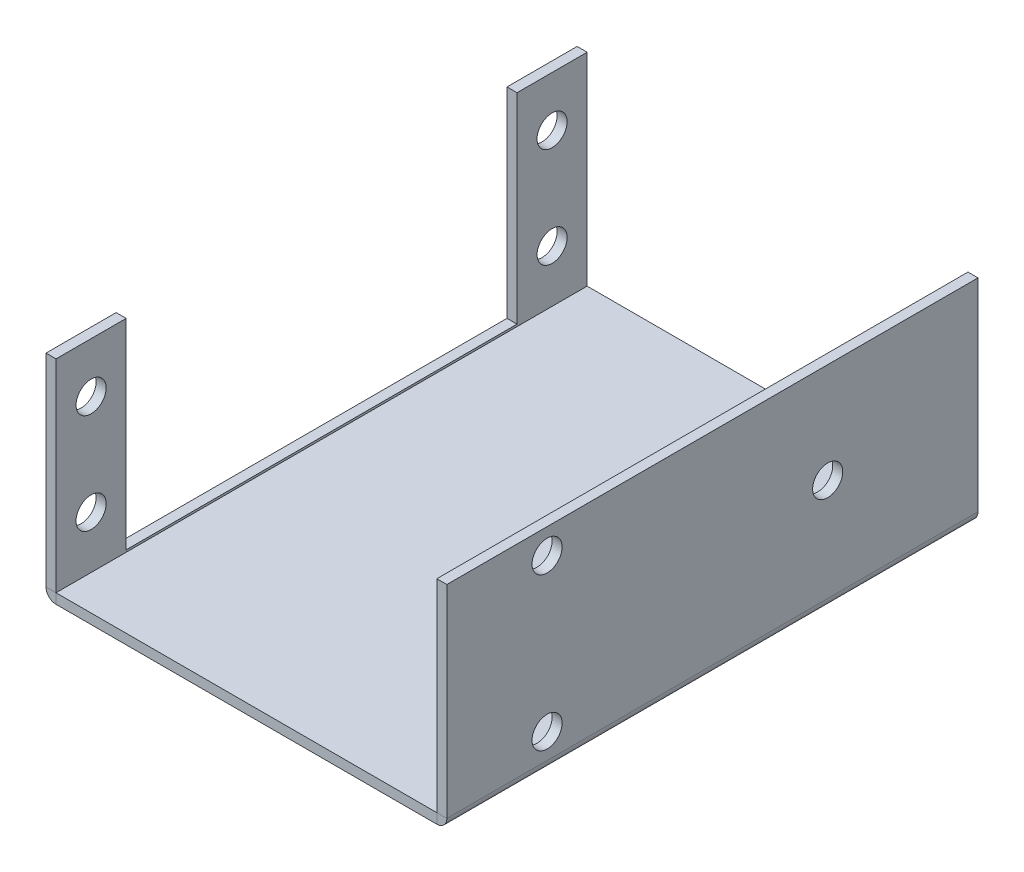
ISO-10303-21;
HEADER;
FILE_DESCRIPTION(('STEP AP214'),'2;1');
FILE_NAME('part.step','',(''),(''),'','','');
FILE_SCHEMA(('AUTOMOTIVE_DESIGN { 1 0 10303 214 1 1 1 1 }'));
ENDSEC;
DATA;
#1=APPLICATION_CONTEXT('core data for automotive mechanical design processes');
#2=APPLICATION_PROTOCOL_DEFINITION('international standard','automotive_design',2000,#1);
#3=PRODUCT_CONTEXT('',#1,'mechanical');
#4=PRODUCT('Part','Part','',(#3));
#5=PRODUCT_RELATED_PRODUCT_CATEGORY('part','',(#4));
#6=PRODUCT_DEFINITION_FORMATION('','',#4);
#7=PRODUCT_DEFINITION_CONTEXT('part definition',#1,'design');
#8=PRODUCT_DEFINITION('design','',#6,#7);
#9=PRODUCT_DEFINITION_SHAPE('','',#8);
#10=(LENGTH_UNIT() NAMED_UNIT(*) SI_UNIT(.MILLI.,.METRE.));
#11=(NAMED_UNIT(*) PLANE_ANGLE_UNIT() SI_UNIT($,.RADIAN.));
#12=(NAMED_UNIT(*) SI_UNIT($,.STERADIAN.) SOLID_ANGLE_UNIT());
#13=UNCERTAINTY_MEASURE_WITH_UNIT(LENGTH_MEASURE(1.E-05),#10,'distance_accuracy_value','');
#14=(GEOMETRIC_REPRESENTATION_CONTEXT(3) GLOBAL_UNCERTAINTY_ASSIGNED_CONTEXT((#13)) GLOBAL_UNIT_ASSIGNED_CONTEXT((#10,
#11,#12)) REPRESENTATION_CONTEXT('',''));
#15=CARTESIAN_POINT('',(0.,0.,0.));
#16=DIRECTION('',(0.,0.,1.));
#17=DIRECTION('',(1.,0.,0.));
#18=AXIS2_PLACEMENT_3D('',#15,#16,#17);
#19=CARTESIAN_POINT('',(0.,1.,0.));
#20=DIRECTION('',(0.,0.,1.));
#21=DIRECTION('',(-1.,0.,0.));
#22=AXIS2_PLACEMENT_3D('',#19,#20,#21);
#23=PLANE('',#22);
#24=DIRECTION('',(-1.,0.,0.));
#25=VECTOR('',#24,1.);
#26=CARTESIAN_POINT('',(0.,1.,0.));
#27=LINE('',#26,#25);
#28=CARTESIAN_POINT('',(-21.,1.,0.));
#29=VERTEX_POINT('',#28);
#30=CARTESIAN_POINT('',(-59.,1.,0.));
#31=VERTEX_POINT('',#30);
#32=EDGE_CURVE('E204',#29,#31,#27,.T.);
#33=ORIENTED_EDGE('',*,*,#32,.F.);
#34=DIRECTION('',(0.,-1.,0.));
#35=VECTOR('',#34,1.);
#36=CARTESIAN_POINT('',(-21.,1.,0.));
#37=LINE('',#36,#35);
#38=CARTESIAN_POINT('',(-21.,0.,0.));
#39=VERTEX_POINT('',#38);
#40=EDGE_CURVE('E12',#29,#39,#37,.T.);
#41=ORIENTED_EDGE('',*,*,#40,.T.);
#42=DIRECTION('',(1.,0.,0.));
#43=VECTOR('',#42,1.);
#44=CARTESIAN_POINT('',(0.,0.,0.));
#45=LINE('',#44,#43);
#46=CARTESIAN_POINT('',(-59.,0.,0.));
#47=VERTEX_POINT('',#46);
#48=EDGE_CURVE('E196',#39,#47,#45,.F.);
#49=ORIENTED_EDGE('',*,*,#48,.T.);
#50=DIRECTION('',(0.,1.,0.));
#51=VECTOR('',#50,1.);
#52=CARTESIAN_POINT('',(-59.,1.,0.));
#53=LINE('',#52,#51);
#54=EDGE_CURVE('E192',#47,#31,#53,.T.);
#55=ORIENTED_EDGE('',*,*,#54,.T.);
#56=EDGE_LOOP('',(#33,#41,#49,#55));
#57=FACE_BOUND('',#56,.T.);
#58=ADVANCED_FACE('F42',(#57),#23,.F.);
#59=CARTESIAN_POINT('',(0.,0.,0.));
#60=DIRECTION('',(0.,-1.,0.));
#61=DIRECTION('',(0.,0.,-1.));
#62=AXIS2_PLACEMENT_3D('',#59,#60,#61);
#63=PLANE('',#62);
#64=ORIENTED_EDGE('',*,*,#48,.F.);
#65=DIRECTION('',(0.,0.,1.));
#66=VECTOR('',#65,1.);
#67=CARTESIAN_POINT('',(-21.,0.,0.));
#68=LINE('',#67,#66);
#69=CARTESIAN_POINT('',(-21.,0.,53.));
#70=VERTEX_POINT('',#69);
#71=EDGE_CURVE('E50',#39,#70,#68,.T.);
#72=ORIENTED_EDGE('',*,*,#71,.T.);
#73=DIRECTION('',(1.,0.,0.));
#74=VECTOR('',#73,1.);
#75=CARTESIAN_POINT('',(0.,0.,53.));
#76=LINE('',#75,#74);
#77=CARTESIAN_POINT('',(-59.,0.,53.));
#78=VERTEX_POINT('',#77);
#79=EDGE_CURVE('E200',#78,#70,#76,.T.);
#80=ORIENTED_EDGE('',*,*,#79,.F.);
#81=DIRECTION('',(0.,0.,-1.));
#82=VECTOR('',#81,1.);
#83=CARTESIAN_POINT('',(-59.,0.,0.));
#84=LINE('',#83,#82);
#85=EDGE_CURVE('E197',#78,#47,#84,.T.);
#86=ORIENTED_EDGE('',*,*,#85,.T.);
#87=EDGE_LOOP('',(#64,#72,#80,#86));
#88=FACE_BOUND('',#87,.T.);
#89=ADVANCED_FACE('F354',(#88),#63,.T.);
#90=CARTESIAN_POINT('',(0.,1.,53.));
#91=DIRECTION('',(0.,0.,-1.));
#92=DIRECTION('',(1.,0.,0.));
#93=AXIS2_PLACEMENT_3D('',#90,#91,#92);
#94=PLANE('',#93);
#95=ORIENTED_EDGE('',*,*,#79,.T.);
#96=DIRECTION('',(0.,1.,0.));
#97=VECTOR('',#96,1.);
#98=CARTESIAN_POINT('',(-21.,1.,53.));
#99=LINE('',#98,#97);
#100=CARTESIAN_POINT('',(-21.,1.,53.));
#101=VERTEX_POINT('',#100);
#102=EDGE_CURVE('E293',#70,#101,#99,.T.);
#103=ORIENTED_EDGE('',*,*,#102,.T.);
#104=DIRECTION('',(1.,0.,0.));
#105=VECTOR('',#104,1.);
#106=CARTESIAN_POINT('',(0.,1.,53.));
#107=LINE('',#106,#105);
#108=CARTESIAN_POINT('',(-59.,1.,53.));
#109=VERTEX_POINT('',#108);
#110=EDGE_CURVE('E207',#109,#101,#107,.T.);
#111=ORIENTED_EDGE('',*,*,#110,.F.);
#112=DIRECTION('',(0.,-1.,0.));
#113=VECTOR('',#112,1.);
#114=CARTESIAN_POINT('',(-59.,1.,53.));
#115=LINE('',#114,#113);
#116=EDGE_CURVE('E201',#109,#78,#115,.T.);
#117=ORIENTED_EDGE('',*,*,#116,.T.);
#118=EDGE_LOOP('',(#95,#103,#111,#117));
#119=FACE_BOUND('',#118,.T.);
#120=ADVANCED_FACE('F399',(#119),#94,.F.);
#121=CARTESIAN_POINT('',(-59.0000000000002,-58.7853981633975,0.));
#122=DIRECTION('',(-1.,0.,0.));
#123=DIRECTION('',(0.,0.,-1.));
#124=AXIS2_PLACEMENT_3D('',#121,#122,#123);
#125=PLANE('',#124);
#126=CARTESIAN_POINT('',(-59.,16.2146018366026,3.5));
#127=DIRECTION('',(-1.,0.,0.));
#128=DIRECTION('',(0.,0.,-1.));
#129=AXIS2_PLACEMENT_3D('',#126,#127,#128);
#130=CIRCLE('',#129,1.5);
#131=CARTESIAN_POINT('',(-59.,16.2146018366026,2.00000000000001));
#132=VERTEX_POINT('',#131);
#133=EDGE_CURVE('E218',#132,#132,#130,.F.);
#134=ORIENTED_EDGE('',*,*,#133,.F.);
#135=EDGE_LOOP('',(#134));
#136=FACE_BOUND('',#135,.T.);
#137=CARTESIAN_POINT('',(-59.,6.21460183660256,3.5));
#138=DIRECTION('',(-1.,0.,0.));
#139=DIRECTION('',(0.,0.,-1.));
#140=AXIS2_PLACEMENT_3D('',#137,#138,#139);
#141=CIRCLE('',#140,1.5);
#142=CARTESIAN_POINT('',(-59.,6.21460183660256,2.00000000000001));
#143=VERTEX_POINT('',#142);
#144=EDGE_CURVE('E215',#143,#143,#141,.F.);
#145=ORIENTED_EDGE('',*,*,#144,.F.);
#146=EDGE_LOOP('',(#145));
#147=FACE_BOUND('',#146,.T.);
#148=CARTESIAN_POINT('',(-59.,16.2146018366026,49.5));
#149=DIRECTION('',(-1.,0.,0.));
#150=DIRECTION('',(0.,0.,-1.));
#151=AXIS2_PLACEMENT_3D('',#148,#149,#150);
#152=CIRCLE('',#151,1.5);
#153=CARTESIAN_POINT('',(-59.,16.2146018366026,48.));
#154=VERTEX_POINT('',#153);
#155=EDGE_CURVE('E211',#154,#154,#152,.F.);
#156=ORIENTED_EDGE('',*,*,#155,.F.);
#157=EDGE_LOOP('',(#156));
#158=FACE_BOUND('',#157,.T.);
#159=CARTESIAN_POINT('',(-59.,6.21460183660256,49.5));
#160=DIRECTION('',(-1.,0.,0.));
#161=DIRECTION('',(0.,0.,-1.));
#162=AXIS2_PLACEMENT_3D('',#159,#160,#161);
#163=CIRCLE('',#162,1.5);
#164=CARTESIAN_POINT('',(-59.,6.21460183660256,48.));
#165=VERTEX_POINT('',#164);
#166=EDGE_CURVE('E208',#165,#165,#163,.F.);
#167=ORIENTED_EDGE('',*,*,#166,.F.);
#168=EDGE_LOOP('',(#167));
#169=FACE_BOUND('',#168,.T.);
#170=DIRECTION('',(0.,-1.,0.));
#171=VECTOR('',#170,1.);
#172=CARTESIAN_POINT('',(-59.0000000000002,-58.7853981633975,53.));
#173=LINE('',#172,#171);
#174=CARTESIAN_POINT('',(-58.9999999999999,21.2146018366026,53.));
#175=VERTEX_POINT('',#174);
#176=EDGE_CURVE('E237',#175,#109,#173,.T.);
#177=ORIENTED_EDGE('',*,*,#176,.T.);
#178=DIRECTION('',(0.,0.,-1.));
#179=VECTOR('',#178,1.);
#180=CARTESIAN_POINT('',(-59.,1.,0.));
#181=LINE('',#180,#179);
#182=EDGE_CURVE('E191',#109,#31,#181,.T.);
#183=ORIENTED_EDGE('',*,*,#182,.T.);
#184=DIRECTION('',(0.,1.,0.));
#185=VECTOR('',#184,1.);
#186=CARTESIAN_POINT('',(-59.0000000000002,-58.7853981633975,0.));
#187=LINE('',#186,#185);
#188=CARTESIAN_POINT('',(-58.9999999999999,21.2146018366026,0.));
#189=VERTEX_POINT('',#188);
#190=EDGE_CURVE('E221',#31,#189,#187,.T.);
#191=ORIENTED_EDGE('',*,*,#190,.T.);
#192=DIRECTION('',(0.,0.,1.));
#193=VECTOR('',#192,1.);
#194=CARTESIAN_POINT('',(-58.9999999999999,21.2146018366026,0.));
#195=LINE('',#194,#193);
#196=CARTESIAN_POINT('',(-58.9999999999999,21.2146018366026,7.00000000000001));
#197=VERTEX_POINT('',#196);
#198=EDGE_CURVE('E222',#189,#197,#195,.T.);
#199=ORIENTED_EDGE('',*,*,#198,.T.);
#200=DIRECTION('',(0.,-1.,0.));
#201=VECTOR('',#200,1.);
#202=CARTESIAN_POINT('',(-58.9999999999999,21.2146018366026,7.00000000000001));
#203=LINE('',#202,#201);
#204=CARTESIAN_POINT('',(-59.,1.21460183660255,7.00000000000001));
#205=VERTEX_POINT('',#204);
#206=EDGE_CURVE('E225',#197,#205,#203,.T.);
#207=ORIENTED_EDGE('',*,*,#206,.T.);
#208=DIRECTION('',(0.,0.,1.));
#209=VECTOR('',#208,1.);
#210=CARTESIAN_POINT('',(-59.,1.21460183660255,7.00000000000001));
#211=LINE('',#210,#209);
#212=CARTESIAN_POINT('',(-59.,1.21460183660255,46.));
#213=VERTEX_POINT('',#212);
#214=EDGE_CURVE('E228',#205,#213,#211,.T.);
#215=ORIENTED_EDGE('',*,*,#214,.T.);
#216=DIRECTION('',(0.,1.,0.));
#217=VECTOR('',#216,1.);
#218=CARTESIAN_POINT('',(-58.9999999999999,21.2146018366026,46.));
#219=LINE('',#218,#217);
#220=CARTESIAN_POINT('',(-58.9999999999999,21.2146018366026,46.));
#221=VERTEX_POINT('',#220);
#222=EDGE_CURVE('E231',#213,#221,#219,.T.);
#223=ORIENTED_EDGE('',*,*,#222,.T.);
#224=DIRECTION('',(0.,0.,1.));
#225=VECTOR('',#224,1.);
#226=CARTESIAN_POINT('',(-58.9999999999999,21.2146018366026,53.));
#227=LINE('',#226,#225);
#228=EDGE_CURVE('E234',#221,#175,#227,.T.);
#229=ORIENTED_EDGE('',*,*,#228,.T.);
#230=EDGE_LOOP('',(#177,#183,#191,#199,#207,#215,#223,#229));
#231=FACE_BOUND('',#230,.T.);
#232=ADVANCED_FACE('F403',(#136,#147,#158,#169,#231),#125,.F.);
#233=CARTESIAN_POINT('',(-58.9999999999999,21.2146018366026,0.));
#234=DIRECTION('',(0.,-1.,0.));
#235=DIRECTION('',(0.,0.,1.));
#236=AXIS2_PLACEMENT_3D('',#233,#234,#235);
#237=PLANE('',#236);
#238=DIRECTION('',(1.,0.,0.));
#239=VECTOR('',#238,1.);
#240=CARTESIAN_POINT('',(-58.9999999999999,21.2146018366026,0.));
#241=LINE('',#240,#239);
#242=CARTESIAN_POINT('',(-59.9999999999999,21.2146018366026,0.));
#243=VERTEX_POINT('',#242);
#244=EDGE_CURVE('E274',#243,#189,#241,.T.);
#245=ORIENTED_EDGE('',*,*,#244,.F.);
#246=DIRECTION('',(0.,0.,-1.));
#247=VECTOR('',#246,1.);
#248=CARTESIAN_POINT('',(-59.9999999999999,21.2146018366026,0.));
#249=LINE('',#248,#247);
#250=CARTESIAN_POINT('',(-59.9999999999999,21.2146018366026,7.00000000000001));
#251=VERTEX_POINT('',#250);
#252=EDGE_CURVE('E261',#243,#251,#249,.F.);
#253=ORIENTED_EDGE('',*,*,#252,.T.);
#254=DIRECTION('',(1.,0.,0.));
#255=VECTOR('',#254,1.);
#256=CARTESIAN_POINT('',(-58.9999999999999,21.2146018366026,7.00000000000001));
#257=LINE('',#256,#255);
#258=EDGE_CURVE('E272',#251,#197,#257,.T.);
#259=ORIENTED_EDGE('',*,*,#258,.T.);
#260=ORIENTED_EDGE('',*,*,#198,.F.);
#261=EDGE_LOOP('',(#245,#253,#259,#260));
#262=FACE_BOUND('',#261,.T.);
#263=ADVANCED_FACE('F415',(#262),#237,.F.);
#264=CARTESIAN_POINT('',(-58.9999999999999,21.2146018366026,7.00000000000001));
#265=DIRECTION('',(0.,0.,-1.));
#266=DIRECTION('',(0.,-1.,0.));
#267=AXIS2_PLACEMENT_3D('',#264,#265,#266);
#268=PLANE('',#267);
#269=ORIENTED_EDGE('',*,*,#258,.F.);
#270=DIRECTION('',(0.,-1.,0.));
#271=VECTOR('',#270,1.);
#272=CARTESIAN_POINT('',(-60.0000000000002,-58.7853981633974,7.00000000000001));
#273=LINE('',#272,#271);
#274=CARTESIAN_POINT('',(-60.,1.21460183660255,7.00000000000001));
#275=VERTEX_POINT('',#274);
#276=EDGE_CURVE('E258',#251,#275,#273,.T.);
#277=ORIENTED_EDGE('',*,*,#276,.T.);
#278=DIRECTION('',(1.,0.,0.));
#279=VECTOR('',#278,1.);
#280=CARTESIAN_POINT('',(-59.,1.21460183660255,7.00000000000001));
#281=LINE('',#280,#279);
#282=EDGE_CURVE('E270',#275,#205,#281,.T.);
#283=ORIENTED_EDGE('',*,*,#282,.T.);
#284=ORIENTED_EDGE('',*,*,#206,.F.);
#285=EDGE_LOOP('',(#269,#277,#283,#284));
#286=FACE_BOUND('',#285,.T.);
#287=ADVANCED_FACE('F419',(#286),#268,.F.);
#288=CARTESIAN_POINT('',(-59.,1.21460183660255,7.00000000000001));
#289=DIRECTION('',(0.,-1.,0.));
#290=DIRECTION('',(0.,0.,1.));
#291=AXIS2_PLACEMENT_3D('',#288,#289,#290);
#292=PLANE('',#291);
#293=ORIENTED_EDGE('',*,*,#282,.F.);
#294=DIRECTION('',(0.,0.,-1.));
#295=VECTOR('',#294,1.);
#296=CARTESIAN_POINT('',(-60.,1.21460183660255,0.));
#297=LINE('',#296,#295);
#298=CARTESIAN_POINT('',(-60.,1.21460183660255,46.));
#299=VERTEX_POINT('',#298);
#300=EDGE_CURVE('E255',#275,#299,#297,.F.);
#301=ORIENTED_EDGE('',*,*,#300,.T.);
#302=DIRECTION('',(1.,0.,0.));
#303=VECTOR('',#302,1.);
#304=CARTESIAN_POINT('',(-59.,1.21460183660255,46.));
#305=LINE('',#304,#303);
#306=EDGE_CURVE('E268',#299,#213,#305,.T.);
#307=ORIENTED_EDGE('',*,*,#306,.T.);
#308=ORIENTED_EDGE('',*,*,#214,.F.);
#309=EDGE_LOOP('',(#293,#301,#307,#308));
#310=FACE_BOUND('',#309,.T.);
#311=ADVANCED_FACE('F423',(#310),#292,.F.);
#312=CARTESIAN_POINT('',(-58.9999999999999,21.2146018366026,46.));
#313=DIRECTION('',(0.,0.,1.));
#314=DIRECTION('',(0.,1.,0.));
#315=AXIS2_PLACEMENT_3D('',#312,#313,#314);
#316=PLANE('',#315);
#317=ORIENTED_EDGE('',*,*,#306,.F.);
#318=DIRECTION('',(0.,-1.,0.));
#319=VECTOR('',#318,1.);
#320=CARTESIAN_POINT('',(-60.0000000000002,-58.7853981633974,46.));
#321=LINE('',#320,#319);
#322=CARTESIAN_POINT('',(-59.9999999999999,21.2146018366026,46.));
#323=VERTEX_POINT('',#322);
#324=EDGE_CURVE('E252',#299,#323,#321,.F.);
#325=ORIENTED_EDGE('',*,*,#324,.T.);
#326=DIRECTION('',(1.,0.,0.));
#327=VECTOR('',#326,1.);
#328=CARTESIAN_POINT('',(-58.9999999999999,21.2146018366026,46.));
#329=LINE('',#328,#327);
#330=EDGE_CURVE('E266',#323,#221,#329,.T.);
#331=ORIENTED_EDGE('',*,*,#330,.T.);
#332=ORIENTED_EDGE('',*,*,#222,.F.);
#333=EDGE_LOOP('',(#317,#325,#331,#332));
#334=FACE_BOUND('',#333,.T.);
#335=ADVANCED_FACE('F427',(#334),#316,.F.);
#336=CARTESIAN_POINT('',(-58.9999999999999,21.2146018366026,53.));
#337=DIRECTION('',(0.,-1.,0.));
#338=DIRECTION('',(0.,0.,1.));
#339=AXIS2_PLACEMENT_3D('',#336,#337,#338);
#340=PLANE('',#339);
#341=ORIENTED_EDGE('',*,*,#330,.F.);
#342=DIRECTION('',(0.,0.,-1.));
#343=VECTOR('',#342,1.);
#344=CARTESIAN_POINT('',(-59.9999999999999,21.2146018366026,0.));
#345=LINE('',#344,#343);
#346=CARTESIAN_POINT('',(-59.9999999999999,21.2146018366026,53.));
#347=VERTEX_POINT('',#346);
#348=EDGE_CURVE('E249',#323,#347,#345,.F.);
#349=ORIENTED_EDGE('',*,*,#348,.T.);
#350=DIRECTION('',(1.,0.,0.));
#351=VECTOR('',#350,1.);
#352=CARTESIAN_POINT('',(-58.9999999999999,21.2146018366026,53.));
#353=LINE('',#352,#351);
#354=EDGE_CURVE('E264',#347,#175,#353,.T.);
#355=ORIENTED_EDGE('',*,*,#354,.T.);
#356=ORIENTED_EDGE('',*,*,#228,.F.);
#357=EDGE_LOOP('',(#341,#349,#355,#356));
#358=FACE_BOUND('',#357,.T.);
#359=ADVANCED_FACE('F412',(#358),#340,.F.);
#360=CARTESIAN_POINT('',(-59.0000000000002,-58.7853981633975,53.));
#361=DIRECTION('',(0.,0.,-1.));
#362=DIRECTION('',(0.,-1.,0.));
#363=AXIS2_PLACEMENT_3D('',#360,#361,#362);
#364=PLANE('',#363);
#365=DIRECTION('',(-1.,0.,0.));
#366=VECTOR('',#365,1.);
#367=CARTESIAN_POINT('',(-59.,1.,53.));
#368=LINE('',#367,#366);
#369=CARTESIAN_POINT('',(-60.,1.00000000000001,53.));
#370=VERTEX_POINT('',#369);
#371=EDGE_CURVE('E277',#109,#370,#368,.T.);
#372=ORIENTED_EDGE('',*,*,#371,.F.);
#373=ORIENTED_EDGE('',*,*,#176,.F.);
#374=ORIENTED_EDGE('',*,*,#354,.F.);
#375=DIRECTION('',(0.,-1.,0.));
#376=VECTOR('',#375,1.);
#377=CARTESIAN_POINT('',(-60.0000000000002,-58.7853981633974,53.));
#378=LINE('',#377,#376);
#379=EDGE_CURVE('E212',#347,#370,#378,.T.);
#380=ORIENTED_EDGE('',*,*,#379,.T.);
#381=EDGE_LOOP('',(#372,#373,#374,#380));
#382=FACE_BOUND('',#381,.T.);
#383=ADVANCED_FACE('F364',(#382),#364,.F.);
#384=CARTESIAN_POINT('',(-59.,6.21460183660256,49.5));
#385=DIRECTION('',(-1.,0.,0.));
#386=DIRECTION('',(0.,0.,-1.));
#387=AXIS2_PLACEMENT_3D('',#384,#385,#386);
#388=CYLINDRICAL_SURFACE('',#387,1.5);
#389=ORIENTED_EDGE('',*,*,#166,.T.);
#390=EDGE_LOOP('',(#389));
#391=FACE_BOUND('',#390,.T.);
#392=CARTESIAN_POINT('',(-60.,6.21460183660256,49.5));
#393=DIRECTION('',(-1.,0.,0.));
#394=DIRECTION('',(0.,0.,-1.));
#395=AXIS2_PLACEMENT_3D('',#392,#393,#394);
#396=CIRCLE('',#395,1.5);
#397=CARTESIAN_POINT('',(-60.,6.21460183660256,48.));
#398=VERTEX_POINT('',#397);
#399=EDGE_CURVE('E195',#398,#398,#396,.F.);
#400=ORIENTED_EDGE('',*,*,#399,.F.);
#401=EDGE_LOOP('',(#400));
#402=FACE_BOUND('',#401,.T.);
#403=ADVANCED_FACE('F411',(#391,#402),#388,.F.);
#404=CARTESIAN_POINT('',(-59.,16.2146018366026,49.5));
#405=DIRECTION('',(-1.,0.,0.));
#406=DIRECTION('',(0.,0.,-1.));
#407=AXIS2_PLACEMENT_3D('',#404,#405,#406);
#408=CYLINDRICAL_SURFACE('',#407,1.5);
#409=ORIENTED_EDGE('',*,*,#155,.T.);
#410=EDGE_LOOP('',(#409));
#411=FACE_BOUND('',#410,.T.);
#412=CARTESIAN_POINT('',(-60.,16.2146018366026,49.5));
#413=DIRECTION('',(-1.,0.,0.));
#414=DIRECTION('',(0.,0.,-1.));
#415=AXIS2_PLACEMENT_3D('',#412,#413,#414);
#416=CIRCLE('',#415,1.5);
#417=CARTESIAN_POINT('',(-60.,16.2146018366026,48.));
#418=VERTEX_POINT('',#417);
#419=EDGE_CURVE('E240',#418,#418,#416,.F.);
#420=ORIENTED_EDGE('',*,*,#419,.F.);
#421=EDGE_LOOP('',(#420));
#422=FACE_BOUND('',#421,.T.);
#423=ADVANCED_FACE('F391',(#411,#422),#408,.F.);
#424=CARTESIAN_POINT('',(-59.,6.21460183660256,3.5));
#425=DIRECTION('',(-1.,0.,0.));
#426=DIRECTION('',(0.,0.,-1.));
#427=AXIS2_PLACEMENT_3D('',#424,#425,#426);
#428=CYLINDRICAL_SURFACE('',#427,1.5);
#429=ORIENTED_EDGE('',*,*,#144,.T.);
#430=EDGE_LOOP('',(#429));
#431=FACE_BOUND('',#430,.T.);
#432=CARTESIAN_POINT('',(-60.,6.21460183660256,3.5));
#433=DIRECTION('',(-1.,0.,0.));
#434=DIRECTION('',(0.,0.,-1.));
#435=AXIS2_PLACEMENT_3D('',#432,#433,#434);
#436=CIRCLE('',#435,1.5);
#437=CARTESIAN_POINT('',(-60.,6.21460183660256,2.00000000000001));
#438=VERTEX_POINT('',#437);
#439=EDGE_CURVE('E243',#438,#438,#436,.F.);
#440=ORIENTED_EDGE('',*,*,#439,.F.);
#441=EDGE_LOOP('',(#440));
#442=FACE_BOUND('',#441,.T.);
#443=ADVANCED_FACE('F382',(#431,#442),#428,.F.);
#444=CARTESIAN_POINT('',(-59.,16.2146018366026,3.5));
#445=DIRECTION('',(-1.,0.,0.));
#446=DIRECTION('',(0.,0.,-1.));
#447=AXIS2_PLACEMENT_3D('',#444,#445,#446);
#448=CYLINDRICAL_SURFACE('',#447,1.5);
#449=ORIENTED_EDGE('',*,*,#133,.T.);
#450=EDGE_LOOP('',(#449));
#451=FACE_BOUND('',#450,.T.);
#452=CARTESIAN_POINT('',(-60.,16.2146018366026,3.5));
#453=DIRECTION('',(-1.,0.,0.));
#454=DIRECTION('',(0.,0.,-1.));
#455=AXIS2_PLACEMENT_3D('',#452,#453,#454);
#456=CIRCLE('',#455,1.5);
#457=CARTESIAN_POINT('',(-60.,16.2146018366026,2.00000000000001));
#458=VERTEX_POINT('',#457);
#459=EDGE_CURVE('E246',#458,#458,#456,.F.);
#460=ORIENTED_EDGE('',*,*,#459,.F.);
#461=EDGE_LOOP('',(#460));
#462=FACE_BOUND('',#461,.T.);
#463=ADVANCED_FACE('F380',(#451,#462),#448,.F.);
#464=CARTESIAN_POINT('',(-59.0000000000002,-58.7853981633975,0.));
#465=DIRECTION('',(0.,0.,1.));
#466=DIRECTION('',(0.,1.,0.));
#467=AXIS2_PLACEMENT_3D('',#464,#465,#466);
#468=PLANE('',#467);
#469=DIRECTION('',(1.,0.,0.));
#470=VECTOR('',#469,1.);
#471=CARTESIAN_POINT('',(-59.,1.,0.));
#472=LINE('',#471,#470);
#473=CARTESIAN_POINT('',(-60.,1.00000000000001,0.));
#474=VERTEX_POINT('',#473);
#475=EDGE_CURVE('E283',#474,#31,#472,.T.);
#476=ORIENTED_EDGE('',*,*,#475,.F.);
#477=DIRECTION('',(0.,-1.,0.));
#478=VECTOR('',#477,1.);
#479=CARTESIAN_POINT('',(-60.0000000000002,-58.7853981633974,0.));
#480=LINE('',#479,#478);
#481=EDGE_CURVE('E65',#474,#243,#480,.F.);
#482=ORIENTED_EDGE('',*,*,#481,.T.);
#483=ORIENTED_EDGE('',*,*,#244,.T.);
#484=ORIENTED_EDGE('',*,*,#190,.F.);
#485=EDGE_LOOP('',(#476,#482,#483,#484));
#486=FACE_BOUND('',#485,.T.);
#487=ADVANCED_FACE('F370',(#486),#468,.F.);
#488=CARTESIAN_POINT('',(-60.0000000000002,-58.7853981633974,0.));
#489=DIRECTION('',(-1.,0.,0.));
#490=DIRECTION('',(0.,0.,-1.));
#491=AXIS2_PLACEMENT_3D('',#488,#489,#490);
#492=PLANE('',#491);
#493=DIRECTION('',(0.,0.,-1.));
#494=VECTOR('',#493,1.);
#495=CARTESIAN_POINT('',(-60.,1.00000000000001,0.));
#496=LINE('',#495,#494);
#497=EDGE_CURVE('E280',#370,#474,#496,.T.);
#498=ORIENTED_EDGE('',*,*,#497,.F.);
#499=ORIENTED_EDGE('',*,*,#379,.F.);
#500=ORIENTED_EDGE('',*,*,#348,.F.);
#501=ORIENTED_EDGE('',*,*,#324,.F.);
#502=ORIENTED_EDGE('',*,*,#300,.F.);
#503=ORIENTED_EDGE('',*,*,#276,.F.);
#504=ORIENTED_EDGE('',*,*,#252,.F.);
#505=ORIENTED_EDGE('',*,*,#481,.F.);
#506=EDGE_LOOP('',(#498,#499,#500,#501,#502,#503,#504,#505));
#507=FACE_BOUND('',#506,.T.);
#508=ORIENTED_EDGE('',*,*,#399,.T.);
#509=EDGE_LOOP('',(#508));
#510=FACE_BOUND('',#509,.T.);
#511=ORIENTED_EDGE('',*,*,#419,.T.);
#512=EDGE_LOOP('',(#511));
#513=FACE_BOUND('',#512,.T.);
#514=ORIENTED_EDGE('',*,*,#439,.T.);
#515=EDGE_LOOP('',(#514));
#516=FACE_BOUND('',#515,.T.);
#517=ORIENTED_EDGE('',*,*,#459,.T.);
#518=EDGE_LOOP('',(#517));
#519=FACE_BOUND('',#518,.T.);
#520=ADVANCED_FACE('F367',(#507,#510,#513,#516,#519),#492,.T.);
#521=CARTESIAN_POINT('',(0.,1.,0.));
#522=DIRECTION('',(0.,-1.,0.));
#523=DIRECTION('',(0.,0.,-1.));
#524=AXIS2_PLACEMENT_3D('',#521,#522,#523);
#525=PLANE('',#524);
#526=DIRECTION('',(0.,0.,1.));
#527=VECTOR('',#526,1.);
#528=CARTESIAN_POINT('',(-21.,1.,0.));
#529=LINE('',#528,#527);
#530=EDGE_CURVE('E286',#29,#101,#529,.T.);
#531=ORIENTED_EDGE('',*,*,#530,.F.);
#532=ORIENTED_EDGE('',*,*,#32,.T.);
#533=ORIENTED_EDGE('',*,*,#182,.F.);
#534=ORIENTED_EDGE('',*,*,#110,.T.);
#535=EDGE_LOOP('',(#531,#532,#533,#534));
#536=FACE_BOUND('',#535,.T.);
#537=ADVANCED_FACE('F344',(#536),#525,.F.);
#538=CARTESIAN_POINT('',(-59.,1.,0.));
#539=DIRECTION('',(0.,0.,-1.));
#540=DIRECTION('',(-1.,0.,0.));
#541=AXIS2_PLACEMENT_3D('',#538,#539,#540);
#542=PLANE('',#541);
#543=CARTESIAN_POINT('',(-59.,1.,0.));
#544=DIRECTION('',(0.,0.,1.));
#545=DIRECTION('',(1.,0.,0.));
#546=AXIS2_PLACEMENT_3D('',#543,#544,#545);
#547=CIRCLE('',#546,1.00000000000001);
#548=EDGE_CURVE('E188',#474,#47,#547,.T.);
#549=ORIENTED_EDGE('',*,*,#548,.F.);
#550=ORIENTED_EDGE('',*,*,#475,.T.);
#551=ORIENTED_EDGE('',*,*,#54,.F.);
#552=EDGE_LOOP('',(#549,#550,#551));
#553=FACE_BOUND('',#552,.T.);
#554=ADVANCED_FACE('F351',(#553),#542,.T.);
#555=CARTESIAN_POINT('',(-59.,1.,53.));
#556=DIRECTION('',(0.,0.,1.));
#557=DIRECTION('',(1.,0.,0.));
#558=AXIS2_PLACEMENT_3D('',#555,#556,#557);
#559=CYLINDRICAL_SURFACE('',#558,1.00000000000001);
#560=CARTESIAN_POINT('',(-59.,1.,53.));
#561=DIRECTION('',(0.,0.,1.));
#562=DIRECTION('',(1.,0.,0.));
#563=AXIS2_PLACEMENT_3D('',#560,#561,#562);
#564=CIRCLE('',#563,1.00000000000001);
#565=EDGE_CURVE('E185',#370,#78,#564,.T.);
#566=ORIENTED_EDGE('',*,*,#565,.F.);
#567=ORIENTED_EDGE('',*,*,#497,.T.);
#568=ORIENTED_EDGE('',*,*,#548,.T.);
#569=ORIENTED_EDGE('',*,*,#85,.F.);
#570=EDGE_LOOP('',(#566,#567,#568,#569));
#571=FACE_BOUND('',#570,.T.);
#572=ADVANCED_FACE('F357',(#571),#559,.T.);
#573=CARTESIAN_POINT('',(-59.,1.,53.));
#574=DIRECTION('',(0.,0.,1.));
#575=DIRECTION('',(1.,0.,0.));
#576=AXIS2_PLACEMENT_3D('',#573,#574,#575);
#577=PLANE('',#576);
#578=ORIENTED_EDGE('',*,*,#371,.T.);
#579=ORIENTED_EDGE('',*,*,#565,.T.);
#580=ORIENTED_EDGE('',*,*,#116,.F.);
#581=EDGE_LOOP('',(#578,#579,#580));
#582=FACE_BOUND('',#581,.T.);
#583=ADVANCED_FACE('F360',(#582),#577,.T.);
#584=CARTESIAN_POINT('',(-21.,1.,53.));
#585=DIRECTION('',(0.,0.,1.));
#586=DIRECTION('',(1.,0.,0.));
#587=AXIS2_PLACEMENT_3D('',#584,#585,#586);
#588=PLANE('',#587);
#589=CARTESIAN_POINT('',(-21.,1.,53.));
#590=DIRECTION('',(0.,0.,-1.));
#591=DIRECTION('',(-1.,0.,0.));
#592=AXIS2_PLACEMENT_3D('',#589,#590,#591);
#593=CIRCLE('',#592,1.);
#594=CARTESIAN_POINT('',(-20.,1.,53.));
#595=VERTEX_POINT('',#594);
#596=EDGE_CURVE('E183',#595,#70,#593,.T.);
#597=ORIENTED_EDGE('',*,*,#596,.F.);
#598=DIRECTION('',(-1.,0.,0.));
#599=VECTOR('',#598,1.);
#600=CARTESIAN_POINT('',(-21.,1.,53.));
#601=LINE('',#600,#599);
#602=EDGE_CURVE('E171',#595,#101,#601,.T.);
#603=ORIENTED_EDGE('',*,*,#602,.T.);
#604=ORIENTED_EDGE('',*,*,#102,.F.);
#605=EDGE_LOOP('',(#597,#603,#604));
#606=FACE_BOUND('',#605,.T.);
#607=ADVANCED_FACE('F448',(#606),#588,.T.);
#608=CARTESIAN_POINT('',(-21.,1.,0.));
#609=DIRECTION('',(0.,0.,-1.));
#610=DIRECTION('',(-1.,0.,0.));
#611=AXIS2_PLACEMENT_3D('',#608,#609,#610);
#612=CYLINDRICAL_SURFACE('',#611,1.);
#613=CARTESIAN_POINT('',(-21.,1.,0.));
#614=DIRECTION('',(0.,0.,-1.));
#615=DIRECTION('',(-1.,0.,0.));
#616=AXIS2_PLACEMENT_3D('',#613,#614,#615);
#617=CIRCLE('',#616,1.);
#618=CARTESIAN_POINT('',(-20.,1.,0.));
#619=VERTEX_POINT('',#618);
#620=EDGE_CURVE('E164',#619,#39,#617,.T.);
#621=ORIENTED_EDGE('',*,*,#620,.F.);
#622=DIRECTION('',(0.,0.,1.));
#623=VECTOR('',#622,1.);
#624=CARTESIAN_POINT('',(-20.,1.,0.));
#625=LINE('',#624,#623);
#626=EDGE_CURVE('E163',#619,#595,#625,.T.);
#627=ORIENTED_EDGE('',*,*,#626,.T.);
#628=ORIENTED_EDGE('',*,*,#596,.T.);
#629=ORIENTED_EDGE('',*,*,#71,.F.);
#630=EDGE_LOOP('',(#621,#627,#628,#629));
#631=FACE_BOUND('',#630,.T.);
#632=ADVANCED_FACE('F465',(#631),#612,.T.);
#633=CARTESIAN_POINT('',(-21.,1.,0.));
#634=DIRECTION('',(0.,0.,-1.));
#635=DIRECTION('',(-1.,0.,0.));
#636=AXIS2_PLACEMENT_3D('',#633,#634,#635);
#637=PLANE('',#636);
#638=DIRECTION('',(1.,0.,0.));
#639=VECTOR('',#638,1.);
#640=CARTESIAN_POINT('',(-21.,1.,0.));
#641=LINE('',#640,#639);
#642=EDGE_CURVE('E178',#29,#619,#641,.T.);
#643=ORIENTED_EDGE('',*,*,#642,.T.);
#644=ORIENTED_EDGE('',*,*,#620,.T.);
#645=ORIENTED_EDGE('',*,*,#40,.F.);
#646=EDGE_LOOP('',(#643,#644,#645));
#647=FACE_BOUND('',#646,.T.);
#648=ADVANCED_FACE('F339',(#647),#637,.T.);
#649=CARTESIAN_POINT('',(-21.0000000000001,21.2146018366025,0.));
#650=DIRECTION('',(0.,-1.,0.));
#651=DIRECTION('',(0.,0.,-1.));
#652=AXIS2_PLACEMENT_3D('',#649,#650,#651);
#653=PLANE('',#652);
#654=DIRECTION('',(-1.,0.,0.));
#655=VECTOR('',#654,1.);
#656=CARTESIAN_POINT('',(-21.0000000000001,21.2146018366026,53.));
#657=LINE('',#656,#655);
#658=CARTESIAN_POINT('',(-20.0000000000001,21.2146018366026,53.));
#659=VERTEX_POINT('',#658);
#660=CARTESIAN_POINT('',(-21.0000000000001,21.2146018366026,53.));
#661=VERTEX_POINT('',#660);
#662=EDGE_CURVE('E170',#659,#661,#657,.T.);
#663=ORIENTED_EDGE('',*,*,#662,.F.);
#664=DIRECTION('',(0.,0.,-1.));
#665=VECTOR('',#664,1.);
#666=CARTESIAN_POINT('',(-20.0000000000001,21.2146018366026,0.));
#667=LINE('',#666,#665);
#668=CARTESIAN_POINT('',(-20.0000000000001,21.2146018366026,0.));
#669=VERTEX_POINT('',#668);
#670=EDGE_CURVE('E156',#659,#669,#667,.T.);
#671=ORIENTED_EDGE('',*,*,#670,.T.);
#672=DIRECTION('',(-1.,0.,0.));
#673=VECTOR('',#672,1.);
#674=CARTESIAN_POINT('',(-21.0000000000001,21.2146018366025,0.));
#675=LINE('',#674,#673);
#676=CARTESIAN_POINT('',(-21.0000000000001,21.2146018366025,0.));
#677=VERTEX_POINT('',#676);
#678=EDGE_CURVE('E144',#669,#677,#675,.T.);
#679=ORIENTED_EDGE('',*,*,#678,.T.);
#680=DIRECTION('',(0.,0.,-1.));
#681=VECTOR('',#680,1.);
#682=CARTESIAN_POINT('',(-21.0000000000001,21.2146018366025,0.));
#683=LINE('',#682,#681);
#684=EDGE_CURVE('E320',#661,#677,#683,.T.);
#685=ORIENTED_EDGE('',*,*,#684,.F.);
#686=EDGE_LOOP('',(#663,#671,#679,#685));
#687=FACE_BOUND('',#686,.T.);
#688=ADVANCED_FACE('F168',(#687),#653,.F.);
#689=CARTESIAN_POINT('',(-21.,11.2146018366026,15.));
#690=DIRECTION('',(1.,0.,0.));
#691=DIRECTION('',(0.,0.,-1.));
#692=AXIS2_PLACEMENT_3D('',#689,#690,#691);
#693=CYLINDRICAL_SURFACE('',#692,1.5);
#694=CARTESIAN_POINT('',(-21.,11.2146018366026,15.));
#695=DIRECTION('',(1.,0.,0.));
#696=DIRECTION('',(0.,0.,-1.));
#697=AXIS2_PLACEMENT_3D('',#694,#695,#696);
#698=CIRCLE('',#697,1.5);
#699=CARTESIAN_POINT('',(-21.,11.2146018366026,13.5));
#700=VERTEX_POINT('',#699);
#701=EDGE_CURVE('E155',#700,#700,#698,.F.);
#702=ORIENTED_EDGE('',*,*,#701,.T.);
#703=EDGE_LOOP('',(#702));
#704=FACE_BOUND('',#703,.T.);
#705=CARTESIAN_POINT('',(-20.,11.2146018366026,15.));
#706=DIRECTION('',(1.,0.,0.));
#707=DIRECTION('',(0.,0.,-1.));
#708=AXIS2_PLACEMENT_3D('',#705,#706,#707);
#709=CIRCLE('',#708,1.5);
#710=CARTESIAN_POINT('',(-20.,11.2146018366026,13.5));
#711=VERTEX_POINT('',#710);
#712=EDGE_CURVE('E165',#711,#711,#709,.F.);
#713=ORIENTED_EDGE('',*,*,#712,.F.);
#714=EDGE_LOOP('',(#713));
#715=FACE_BOUND('',#714,.T.);
#716=ADVANCED_FACE('F327',(#704,#715),#693,.F.);
#717=CARTESIAN_POINT('',(-21.0000000000001,21.2146018366025,0.));
#718=DIRECTION('',(1.,0.,0.));
#719=DIRECTION('',(0.,0.,-1.));
#720=AXIS2_PLACEMENT_3D('',#717,#718,#719);
#721=PLANE('',#720);
#722=CARTESIAN_POINT('',(-21.0000000000001,18.7146018366026,43.));
#723=DIRECTION('',(1.,0.,0.));
#724=DIRECTION('',(0.,1.,0.));
#725=AXIS2_PLACEMENT_3D('',#722,#723,#724);
#726=CIRCLE('',#725,1.5);
#727=CARTESIAN_POINT('',(-21.0000000000001,20.2146018366026,43.));
#728=VERTEX_POINT('',#727);
#729=EDGE_CURVE('E181',#728,#728,#726,.F.);
#730=ORIENTED_EDGE('',*,*,#729,.F.);
#731=EDGE_LOOP('',(#730));
#732=FACE_BOUND('',#731,.T.);
#733=CARTESIAN_POINT('',(-21.,3.5,43.));
#734=DIRECTION('',(1.,0.,0.));
#735=DIRECTION('',(0.,1.,0.));
#736=AXIS2_PLACEMENT_3D('',#733,#734,#735);
#737=CIRCLE('',#736,1.5);
#738=CARTESIAN_POINT('',(-21.,5.,43.));
#739=VERTEX_POINT('',#738);
#740=EDGE_CURVE('E304',#739,#739,#737,.F.);
#741=ORIENTED_EDGE('',*,*,#740,.F.);
#742=EDGE_LOOP('',(#741));
#743=FACE_BOUND('',#742,.T.);
#744=ORIENTED_EDGE('',*,*,#701,.F.);
#745=EDGE_LOOP('',(#744));
#746=FACE_BOUND('',#745,.T.);
#747=DIRECTION('',(0.,-1.,0.));
#748=VECTOR('',#747,1.);
#749=CARTESIAN_POINT('',(-21.0000000000001,21.2146018366025,0.));
#750=LINE('',#749,#748);
#751=EDGE_CURVE('E150',#677,#29,#750,.T.);
#752=ORIENTED_EDGE('',*,*,#751,.T.);
#753=ORIENTED_EDGE('',*,*,#530,.T.);
#754=DIRECTION('',(0.,1.,0.));
#755=VECTOR('',#754,1.);
#756=CARTESIAN_POINT('',(-21.0000000000001,21.2146018366026,53.));
#757=LINE('',#756,#755);
#758=EDGE_CURVE('E322',#101,#661,#757,.T.);
#759=ORIENTED_EDGE('',*,*,#758,.T.);
#760=ORIENTED_EDGE('',*,*,#684,.T.);
#761=EDGE_LOOP('',(#752,#753,#759,#760));
#762=FACE_BOUND('',#761,.T.);
#763=ADVANCED_FACE('F330',(#732,#743,#746,#762),#721,.F.);
#764=CARTESIAN_POINT('',(-21.0000000000001,21.2146018366026,53.));
#765=DIRECTION('',(0.,0.,-1.));
#766=DIRECTION('',(0.,1.,0.));
#767=AXIS2_PLACEMENT_3D('',#764,#765,#766);
#768=PLANE('',#767);
#769=ORIENTED_EDGE('',*,*,#602,.F.);
#770=DIRECTION('',(0.,1.,0.));
#771=VECTOR('',#770,1.);
#772=CARTESIAN_POINT('',(-20.0000000000001,21.2146018366025,53.));
#773=LINE('',#772,#771);
#774=EDGE_CURVE('E318',#595,#659,#773,.T.);
#775=ORIENTED_EDGE('',*,*,#774,.T.);
#776=ORIENTED_EDGE('',*,*,#662,.T.);
#777=ORIENTED_EDGE('',*,*,#758,.F.);
#778=EDGE_LOOP('',(#769,#775,#776,#777));
#779=FACE_BOUND('',#778,.T.);
#780=ADVANCED_FACE('F333',(#779),#768,.F.);
#781=CARTESIAN_POINT('',(-20.0000000000001,21.2146018366026,0.));
#782=DIRECTION('',(1.,0.,0.));
#783=DIRECTION('',(0.,0.,-1.));
#784=AXIS2_PLACEMENT_3D('',#781,#782,#783);
#785=PLANE('',#784);
#786=CARTESIAN_POINT('',(-20.0000000000001,18.7146018366026,43.));
#787=DIRECTION('',(1.,0.,0.));
#788=DIRECTION('',(0.,1.,0.));
#789=AXIS2_PLACEMENT_3D('',#786,#787,#788);
#790=CIRCLE('',#789,1.5);
#791=CARTESIAN_POINT('',(-20.0000000000001,20.2146018366026,43.));
#792=VERTEX_POINT('',#791);
#793=EDGE_CURVE('E45',#792,#792,#790,.F.);
#794=ORIENTED_EDGE('',*,*,#793,.T.);
#795=EDGE_LOOP('',(#794));
#796=FACE_BOUND('',#795,.T.);
#797=CARTESIAN_POINT('',(-20.,3.5,43.));
#798=DIRECTION('',(1.,0.,0.));
#799=DIRECTION('',(0.,1.,0.));
#800=AXIS2_PLACEMENT_3D('',#797,#798,#799);
#801=CIRCLE('',#800,1.5);
#802=CARTESIAN_POINT('',(-20.,5.00000000000001,43.));
#803=VERTEX_POINT('',#802);
#804=EDGE_CURVE('E302',#803,#803,#801,.F.);
#805=ORIENTED_EDGE('',*,*,#804,.T.);
#806=EDGE_LOOP('',(#805));
#807=FACE_BOUND('',#806,.T.);
#808=ORIENTED_EDGE('',*,*,#626,.F.);
#809=DIRECTION('',(0.,1.,0.));
#810=VECTOR('',#809,1.);
#811=CARTESIAN_POINT('',(-20.0000000000001,21.2146018366026,0.));
#812=LINE('',#811,#810);
#813=EDGE_CURVE('E148',#669,#619,#812,.F.);
#814=ORIENTED_EDGE('',*,*,#813,.F.);
#815=ORIENTED_EDGE('',*,*,#670,.F.);
#816=ORIENTED_EDGE('',*,*,#774,.F.);
#817=EDGE_LOOP('',(#808,#814,#815,#816));
#818=FACE_BOUND('',#817,.T.);
#819=ORIENTED_EDGE('',*,*,#712,.T.);
#820=EDGE_LOOP('',(#819));
#821=FACE_BOUND('',#820,.T.);
#822=ADVANCED_FACE('F160',(#796,#807,#818,#821),#785,.T.);
#823=CARTESIAN_POINT('',(-21.0000000000001,21.2146018366025,0.));
#824=DIRECTION('',(0.,0.,1.));
#825=DIRECTION('',(0.,-1.,0.));
#826=AXIS2_PLACEMENT_3D('',#823,#824,#825);
#827=PLANE('',#826);
#828=ORIENTED_EDGE('',*,*,#642,.F.);
#829=ORIENTED_EDGE('',*,*,#751,.F.);
#830=ORIENTED_EDGE('',*,*,#678,.F.);
#831=ORIENTED_EDGE('',*,*,#813,.T.);
#832=EDGE_LOOP('',(#828,#829,#830,#831));
#833=FACE_BOUND('',#832,.T.);
#834=ADVANCED_FACE('F147',(#833),#827,.F.);
#835=CARTESIAN_POINT('',(-10.,3.50000000000004,43.));
#836=DIRECTION('',(-1.,0.,0.));
#837=DIRECTION('',(0.,-1.,0.));
#838=AXIS2_PLACEMENT_3D('',#835,#836,#837);
#839=CYLINDRICAL_SURFACE('',#838,1.5);
#840=ORIENTED_EDGE('',*,*,#804,.F.);
#841=EDGE_LOOP('',(#840));
#842=FACE_BOUND('',#841,.T.);
#843=ORIENTED_EDGE('',*,*,#740,.T.);
#844=EDGE_LOOP('',(#843));
#845=FACE_BOUND('',#844,.T.);
#846=ADVANCED_FACE('F462',(#842,#845),#839,.F.);
#847=CARTESIAN_POINT('',(-10.0000000000001,18.7146018366026,43.));
#848=DIRECTION('',(-1.,0.,0.));
#849=DIRECTION('',(0.,-1.,0.));
#850=AXIS2_PLACEMENT_3D('',#847,#848,#849);
#851=CYLINDRICAL_SURFACE('',#850,1.5);
#852=ORIENTED_EDGE('',*,*,#793,.F.);
#853=EDGE_LOOP('',(#852));
#854=FACE_BOUND('',#853,.T.);
#855=ORIENTED_EDGE('',*,*,#729,.T.);
#856=EDGE_LOOP('',(#855));
#857=FACE_BOUND('',#856,.T.);
#858=ADVANCED_FACE('F634',(#854,#857),#851,.F.);
#859=CLOSED_SHELL('',(#58,#89,#120,#232,#263,#287,#311,#335,#359,#383,#403,#423,#443,#463,#487,
#520,#537,#554,#572,#583,#607,#632,#648,#688,#716,#763,#780,#822,#834,#846,#858));
#860=MANIFOLD_SOLID_BREP('B2',#859);
#861=ADVANCED_BREP_SHAPE_REPRESENTATION('',(#18,#860),#14);
#862=SHAPE_DEFINITION_REPRESENTATION(#9,#861);
ENDSEC;
END-ISO-10303-21;
